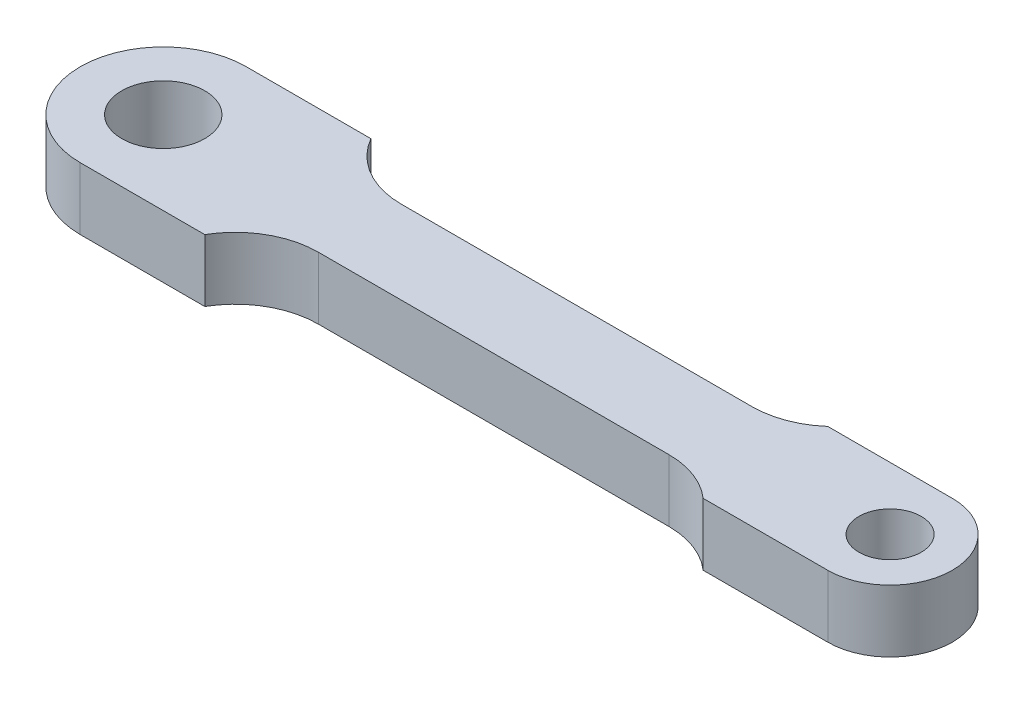
ISO-10303-21;
HEADER;
FILE_DESCRIPTION(('STEP AP214'),'2;1');
FILE_NAME('part.step','',(''),(''),'','','');
FILE_SCHEMA(('AUTOMOTIVE_DESIGN { 1 0 10303 214 1 1 1 1 }'));
ENDSEC;
DATA;
#1=APPLICATION_CONTEXT('core data for automotive mechanical design processes');
#2=APPLICATION_PROTOCOL_DEFINITION('international standard','automotive_design',2000,#1);
#3=PRODUCT_CONTEXT('',#1,'mechanical');
#4=PRODUCT('Part','Part','',(#3));
#5=PRODUCT_RELATED_PRODUCT_CATEGORY('part','',(#4));
#6=PRODUCT_DEFINITION_FORMATION('','',#4);
#7=PRODUCT_DEFINITION_CONTEXT('part definition',#1,'design');
#8=PRODUCT_DEFINITION('design','',#6,#7);
#9=PRODUCT_DEFINITION_SHAPE('','',#8);
#10=(LENGTH_UNIT() NAMED_UNIT(*) SI_UNIT(.MILLI.,.METRE.));
#11=(NAMED_UNIT(*) PLANE_ANGLE_UNIT() SI_UNIT($,.RADIAN.));
#12=(NAMED_UNIT(*) SI_UNIT($,.STERADIAN.) SOLID_ANGLE_UNIT());
#13=UNCERTAINTY_MEASURE_WITH_UNIT(LENGTH_MEASURE(1.E-05),#10,'distance_accuracy_value','');
#14=(GEOMETRIC_REPRESENTATION_CONTEXT(3) GLOBAL_UNCERTAINTY_ASSIGNED_CONTEXT((#13)) GLOBAL_UNIT_ASSIGNED_CONTEXT((#10,
#11,#12)) REPRESENTATION_CONTEXT('',''));
#15=CARTESIAN_POINT('',(0.,0.,0.));
#16=DIRECTION('',(0.,0.,1.));
#17=DIRECTION('',(1.,0.,0.));
#18=AXIS2_PLACEMENT_3D('',#15,#16,#17);
#19=CARTESIAN_POINT('',(-10.519623346751,1.5,0.));
#20=DIRECTION('',(0.,1.,0.));
#21=DIRECTION('',(0.,0.,1.));
#22=AXIS2_PLACEMENT_3D('',#19,#20,#21);
#23=PLANE('',#22);
#24=CARTESIAN_POINT('',(-10.519623346751,1.5,0.));
#25=DIRECTION('',(0.,1.,0.));
#26=DIRECTION('',(0.,0.,1.));
#27=AXIS2_PLACEMENT_3D('',#24,#25,#26);
#28=CIRCLE('',#27,2.);
#29=CARTESIAN_POINT('',(-10.519623346751,1.5,2.));
#30=VERTEX_POINT('',#29);
#31=EDGE_CURVE('E158',#30,#30,#28,.T.);
#32=ORIENTED_EDGE('',*,*,#31,.F.);
#33=EDGE_LOOP('',(#32));
#34=FACE_BOUND('',#33,.T.);
#35=CARTESIAN_POINT('',(-10.519623346751,1.5,0.));
#36=DIRECTION('',(0.,1.,0.));
#37=DIRECTION('',(0.,0.,1.));
#38=AXIS2_PLACEMENT_3D('',#35,#36,#37);
#39=CIRCLE('',#38,4.);
#40=CARTESIAN_POINT('',(-10.519623346751,1.5,-4.));
#41=VERTEX_POINT('',#40);
#42=CARTESIAN_POINT('',(-10.519623346751,1.5,4.));
#43=VERTEX_POINT('',#42);
#44=EDGE_CURVE('E177',#41,#43,#39,.T.);
#45=ORIENTED_EDGE('',*,*,#44,.T.);
#46=DIRECTION('',(1.,0.,0.));
#47=VECTOR('',#46,1.);
#48=CARTESIAN_POINT('',(-10.519623346751,1.5,4.));
#49=LINE('',#48,#47);
#50=CARTESIAN_POINT('',(-4.51962334675103,1.5,4.));
#51=VERTEX_POINT('',#50);
#52=EDGE_CURVE('E105',#43,#51,#49,.T.);
#53=ORIENTED_EDGE('',*,*,#52,.T.);
#54=CARTESIAN_POINT('',(-1.05552173161327,1.5,6.));
#55=DIRECTION('',(0.,-1.,0.));
#56=DIRECTION('',(0.,0.,-1.));
#57=AXIS2_PLACEMENT_3D('',#54,#55,#56);
#58=CIRCLE('',#57,4.);
#59=CARTESIAN_POINT('',(-1.05552173161327,1.5,2.));
#60=VERTEX_POINT('',#59);
#61=EDGE_CURVE('E204',#51,#60,#58,.T.);
#62=ORIENTED_EDGE('',*,*,#61,.T.);
#63=DIRECTION('',(1.,0.,0.));
#64=VECTOR('',#63,1.);
#65=CARTESIAN_POINT('',(-1.05552173161327,1.5,2.));
#66=LINE('',#65,#64);
#67=CARTESIAN_POINT('',(15.8346253421844,1.5,2.));
#68=VERTEX_POINT('',#67);
#69=EDGE_CURVE('E223',#60,#68,#66,.T.);
#70=ORIENTED_EDGE('',*,*,#69,.T.);
#71=CARTESIAN_POINT('',(15.8346253421844,1.5,6.));
#72=DIRECTION('',(0.,-1.,0.));
#73=DIRECTION('',(0.,0.,-1.));
#74=AXIS2_PLACEMENT_3D('',#71,#72,#73);
#75=CIRCLE('',#74,4.);
#76=CARTESIAN_POINT('',(18.480376653249,1.5,3.));
#77=VERTEX_POINT('',#76);
#78=EDGE_CURVE('E220',#68,#77,#75,.T.);
#79=ORIENTED_EDGE('',*,*,#78,.T.);
#80=DIRECTION('',(1.,0.,0.));
#81=VECTOR('',#80,1.);
#82=CARTESIAN_POINT('',(24.480376653249,1.5,3.));
#83=LINE('',#82,#81);
#84=CARTESIAN_POINT('',(24.480376653249,1.5,3.));
#85=VERTEX_POINT('',#84);
#86=EDGE_CURVE('E222',#77,#85,#83,.T.);
#87=ORIENTED_EDGE('',*,*,#86,.T.);
#88=CARTESIAN_POINT('',(24.480376653249,1.5,0.));
#89=DIRECTION('',(0.,1.,0.));
#90=DIRECTION('',(0.,0.,1.));
#91=AXIS2_PLACEMENT_3D('',#88,#89,#90);
#92=CIRCLE('',#91,3.);
#93=CARTESIAN_POINT('',(24.480376653249,1.5,-3.));
#94=VERTEX_POINT('',#93);
#95=EDGE_CURVE('E225',#85,#94,#92,.T.);
#96=ORIENTED_EDGE('',*,*,#95,.T.);
#97=DIRECTION('',(-1.,0.,0.));
#98=VECTOR('',#97,1.);
#99=CARTESIAN_POINT('',(24.480376653249,1.5,-3.));
#100=LINE('',#99,#98);
#101=CARTESIAN_POINT('',(18.480376653249,1.5,-3.));
#102=VERTEX_POINT('',#101);
#103=EDGE_CURVE('E231',#94,#102,#100,.T.);
#104=ORIENTED_EDGE('',*,*,#103,.T.);
#105=CARTESIAN_POINT('',(15.8346253421844,1.5,-6.));
#106=DIRECTION('',(0.,-1.,0.));
#107=DIRECTION('',(0.,0.,1.));
#108=AXIS2_PLACEMENT_3D('',#105,#106,#107);
#109=CIRCLE('',#108,4.);
#110=CARTESIAN_POINT('',(15.8346253421844,1.5,-2.));
#111=VERTEX_POINT('',#110);
#112=EDGE_CURVE('E136',#102,#111,#109,.T.);
#113=ORIENTED_EDGE('',*,*,#112,.T.);
#114=DIRECTION('',(-1.,0.,0.));
#115=VECTOR('',#114,1.);
#116=CARTESIAN_POINT('',(-1.05552173161327,1.5,-2.));
#117=LINE('',#116,#115);
#118=CARTESIAN_POINT('',(-1.05552173161327,1.5,-2.));
#119=VERTEX_POINT('',#118);
#120=EDGE_CURVE('E130',#111,#119,#117,.T.);
#121=ORIENTED_EDGE('',*,*,#120,.T.);
#122=CARTESIAN_POINT('',(-1.05552173161327,1.5,-6.));
#123=DIRECTION('',(0.,-1.,0.));
#124=DIRECTION('',(0.,0.,1.));
#125=AXIS2_PLACEMENT_3D('',#122,#123,#124);
#126=CIRCLE('',#125,4.);
#127=CARTESIAN_POINT('',(-4.51962334675103,1.5,-4.));
#128=VERTEX_POINT('',#127);
#129=EDGE_CURVE('E134',#119,#128,#126,.T.);
#130=ORIENTED_EDGE('',*,*,#129,.T.);
#131=DIRECTION('',(-1.,0.,0.));
#132=VECTOR('',#131,1.);
#133=CARTESIAN_POINT('',(-10.519623346751,1.5,-4.));
#134=LINE('',#133,#132);
#135=EDGE_CURVE('E50',#128,#41,#134,.T.);
#136=ORIENTED_EDGE('',*,*,#135,.T.);
#137=EDGE_LOOP('',(#45,#53,#62,#70,#79,#87,#96,#104,#113,#121,#130,#136));
#138=FACE_BOUND('',#137,.T.);
#139=CARTESIAN_POINT('',(24.480376653249,1.5,0.));
#140=DIRECTION('',(0.,1.,0.));
#141=DIRECTION('',(0.,0.,1.));
#142=AXIS2_PLACEMENT_3D('',#139,#140,#141);
#143=CIRCLE('',#142,1.5);
#144=CARTESIAN_POINT('',(24.480376653249,1.5,1.5));
#145=VERTEX_POINT('',#144);
#146=EDGE_CURVE('E273',#145,#145,#143,.T.);
#147=ORIENTED_EDGE('',*,*,#146,.F.);
#148=EDGE_LOOP('',(#147));
#149=FACE_BOUND('',#148,.T.);
#150=ADVANCED_FACE('F33',(#34,#138,#149),#23,.T.);
#151=CARTESIAN_POINT('',(-10.519623346751,-1.5,0.));
#152=DIRECTION('',(0.,1.,0.));
#153=DIRECTION('',(0.,0.,1.));
#154=AXIS2_PLACEMENT_3D('',#151,#152,#153);
#155=PLANE('',#154);
#156=CARTESIAN_POINT('',(-10.519623346751,-1.5,0.));
#157=DIRECTION('',(0.,1.,0.));
#158=DIRECTION('',(0.,0.,1.));
#159=AXIS2_PLACEMENT_3D('',#156,#157,#158);
#160=CIRCLE('',#159,4.);
#161=CARTESIAN_POINT('',(-10.519623346751,-1.5,-4.));
#162=VERTEX_POINT('',#161);
#163=CARTESIAN_POINT('',(-10.519623346751,-1.5,4.));
#164=VERTEX_POINT('',#163);
#165=EDGE_CURVE('E154',#162,#164,#160,.T.);
#166=ORIENTED_EDGE('',*,*,#165,.F.);
#167=DIRECTION('',(-1.,0.,0.));
#168=VECTOR('',#167,1.);
#169=CARTESIAN_POINT('',(-10.519623346751,-1.5,-4.));
#170=LINE('',#169,#168);
#171=CARTESIAN_POINT('',(-4.51962334675103,-1.5,-4.));
#172=VERTEX_POINT('',#171);
#173=EDGE_CURVE('E97',#172,#162,#170,.T.);
#174=ORIENTED_EDGE('',*,*,#173,.F.);
#175=CARTESIAN_POINT('',(-1.05552173161327,-1.5,-6.));
#176=DIRECTION('',(0.,-1.,0.));
#177=DIRECTION('',(0.,0.,1.));
#178=AXIS2_PLACEMENT_3D('',#175,#176,#177);
#179=CIRCLE('',#178,4.);
#180=CARTESIAN_POINT('',(-1.05552173161327,-1.5,-2.));
#181=VERTEX_POINT('',#180);
#182=EDGE_CURVE('E91',#181,#172,#179,.T.);
#183=ORIENTED_EDGE('',*,*,#182,.F.);
#184=DIRECTION('',(-1.,0.,0.));
#185=VECTOR('',#184,1.);
#186=CARTESIAN_POINT('',(-1.05552173161327,-1.5,-2.));
#187=LINE('',#186,#185);
#188=CARTESIAN_POINT('',(15.8346253421844,-1.5,-2.));
#189=VERTEX_POINT('',#188);
#190=EDGE_CURVE('E144',#189,#181,#187,.T.);
#191=ORIENTED_EDGE('',*,*,#190,.F.);
#192=CARTESIAN_POINT('',(15.8346253421844,-1.5,-6.));
#193=DIRECTION('',(0.,-1.,0.));
#194=DIRECTION('',(0.,0.,1.));
#195=AXIS2_PLACEMENT_3D('',#192,#193,#194);
#196=CIRCLE('',#195,4.);
#197=CARTESIAN_POINT('',(18.480376653249,-1.5,-3.));
#198=VERTEX_POINT('',#197);
#199=EDGE_CURVE('E172',#198,#189,#196,.T.);
#200=ORIENTED_EDGE('',*,*,#199,.F.);
#201=DIRECTION('',(-1.,0.,0.));
#202=VECTOR('',#201,1.);
#203=CARTESIAN_POINT('',(24.480376653249,-1.5,-3.));
#204=LINE('',#203,#202);
#205=CARTESIAN_POINT('',(24.480376653249,-1.5,-3.));
#206=VERTEX_POINT('',#205);
#207=EDGE_CURVE('E170',#206,#198,#204,.T.);
#208=ORIENTED_EDGE('',*,*,#207,.F.);
#209=CARTESIAN_POINT('',(24.480376653249,-1.5,0.));
#210=DIRECTION('',(0.,1.,0.));
#211=DIRECTION('',(0.,0.,1.));
#212=AXIS2_PLACEMENT_3D('',#209,#210,#211);
#213=CIRCLE('',#212,3.);
#214=CARTESIAN_POINT('',(24.480376653249,-1.5,3.));
#215=VERTEX_POINT('',#214);
#216=EDGE_CURVE('E168',#215,#206,#213,.T.);
#217=ORIENTED_EDGE('',*,*,#216,.F.);
#218=DIRECTION('',(1.,0.,0.));
#219=VECTOR('',#218,1.);
#220=CARTESIAN_POINT('',(24.480376653249,-1.5,3.));
#221=LINE('',#220,#219);
#222=CARTESIAN_POINT('',(18.480376653249,-1.5,3.));
#223=VERTEX_POINT('',#222);
#224=EDGE_CURVE('E166',#223,#215,#221,.T.);
#225=ORIENTED_EDGE('',*,*,#224,.F.);
#226=CARTESIAN_POINT('',(15.8346253421844,-1.5,6.));
#227=DIRECTION('',(0.,-1.,0.));
#228=DIRECTION('',(0.,0.,-1.));
#229=AXIS2_PLACEMENT_3D('',#226,#227,#228);
#230=CIRCLE('',#229,4.);
#231=CARTESIAN_POINT('',(15.8346253421844,-1.5,2.));
#232=VERTEX_POINT('',#231);
#233=EDGE_CURVE('E164',#232,#223,#230,.T.);
#234=ORIENTED_EDGE('',*,*,#233,.F.);
#235=DIRECTION('',(1.,0.,0.));
#236=VECTOR('',#235,1.);
#237=CARTESIAN_POINT('',(-1.05552173161327,-1.5,2.));
#238=LINE('',#237,#236);
#239=CARTESIAN_POINT('',(-1.05552173161327,-1.5,2.));
#240=VERTEX_POINT('',#239);
#241=EDGE_CURVE('E162',#240,#232,#238,.T.);
#242=ORIENTED_EDGE('',*,*,#241,.F.);
#243=CARTESIAN_POINT('',(-1.05552173161327,-1.5,6.));
#244=DIRECTION('',(0.,-1.,0.));
#245=DIRECTION('',(0.,0.,-1.));
#246=AXIS2_PLACEMENT_3D('',#243,#244,#245);
#247=CIRCLE('',#246,4.);
#248=CARTESIAN_POINT('',(-4.51962334675103,-1.5,4.));
#249=VERTEX_POINT('',#248);
#250=EDGE_CURVE('E160',#249,#240,#247,.T.);
#251=ORIENTED_EDGE('',*,*,#250,.F.);
#252=DIRECTION('',(1.,0.,0.));
#253=VECTOR('',#252,1.);
#254=CARTESIAN_POINT('',(-10.519623346751,-1.5,4.));
#255=LINE('',#254,#253);
#256=EDGE_CURVE('E157',#164,#249,#255,.T.);
#257=ORIENTED_EDGE('',*,*,#256,.F.);
#258=EDGE_LOOP('',(#166,#174,#183,#191,#200,#208,#217,#225,#234,#242,#251,#257));
#259=FACE_BOUND('',#258,.T.);
#260=CARTESIAN_POINT('',(-10.519623346751,-1.5,0.));
#261=DIRECTION('',(0.,1.,0.));
#262=DIRECTION('',(0.,0.,1.));
#263=AXIS2_PLACEMENT_3D('',#260,#261,#262);
#264=CIRCLE('',#263,2.);
#265=CARTESIAN_POINT('',(-10.519623346751,-1.5,2.));
#266=VERTEX_POINT('',#265);
#267=EDGE_CURVE('E279',#266,#266,#264,.T.);
#268=ORIENTED_EDGE('',*,*,#267,.T.);
#269=EDGE_LOOP('',(#268));
#270=FACE_BOUND('',#269,.T.);
#271=CARTESIAN_POINT('',(24.480376653249,-1.5,0.));
#272=DIRECTION('',(0.,1.,0.));
#273=DIRECTION('',(0.,0.,1.));
#274=AXIS2_PLACEMENT_3D('',#271,#272,#273);
#275=CIRCLE('',#274,1.5);
#276=CARTESIAN_POINT('',(24.480376653249,-1.5,1.5));
#277=VERTEX_POINT('',#276);
#278=EDGE_CURVE('E276',#277,#277,#275,.T.);
#279=ORIENTED_EDGE('',*,*,#278,.T.);
#280=EDGE_LOOP('',(#279));
#281=FACE_BOUND('',#280,.T.);
#282=ADVANCED_FACE('F208',(#259,#270,#281),#155,.F.);
#283=CARTESIAN_POINT('',(-10.519623346751,1.5,0.));
#284=DIRECTION('',(0.,-1.,0.));
#285=DIRECTION('',(0.,0.,-1.));
#286=AXIS2_PLACEMENT_3D('',#283,#284,#285);
#287=CYLINDRICAL_SURFACE('',#286,4.);
#288=ORIENTED_EDGE('',*,*,#165,.T.);
#289=DIRECTION('',(0.,-1.,0.));
#290=VECTOR('',#289,1.);
#291=CARTESIAN_POINT('',(-10.519623346751,1.5,4.));
#292=LINE('',#291,#290);
#293=EDGE_CURVE('E11',#43,#164,#292,.T.);
#294=ORIENTED_EDGE('',*,*,#293,.F.);
#295=ORIENTED_EDGE('',*,*,#44,.F.);
#296=DIRECTION('',(0.,-1.,0.));
#297=VECTOR('',#296,1.);
#298=CARTESIAN_POINT('',(-10.519623346751,1.5,-4.));
#299=LINE('',#298,#297);
#300=EDGE_CURVE('E150',#41,#162,#299,.T.);
#301=ORIENTED_EDGE('',*,*,#300,.T.);
#302=EDGE_LOOP('',(#288,#294,#295,#301));
#303=FACE_BOUND('',#302,.T.);
#304=ADVANCED_FACE('F35',(#303),#287,.T.);
#305=CARTESIAN_POINT('',(-10.519623346751,1.5,4.));
#306=DIRECTION('',(0.,0.,-1.));
#307=DIRECTION('',(-1.,0.,0.));
#308=AXIS2_PLACEMENT_3D('',#305,#306,#307);
#309=PLANE('',#308);
#310=ORIENTED_EDGE('',*,*,#256,.T.);
#311=DIRECTION('',(0.,-1.,0.));
#312=VECTOR('',#311,1.);
#313=CARTESIAN_POINT('',(-4.51962334675103,1.5,4.));
#314=LINE('',#313,#312);
#315=EDGE_CURVE('E42',#51,#249,#314,.T.);
#316=ORIENTED_EDGE('',*,*,#315,.F.);
#317=ORIENTED_EDGE('',*,*,#52,.F.);
#318=ORIENTED_EDGE('',*,*,#293,.T.);
#319=EDGE_LOOP('',(#310,#316,#317,#318));
#320=FACE_BOUND('',#319,.T.);
#321=ADVANCED_FACE('F372',(#320),#309,.F.);
#322=CARTESIAN_POINT('',(-1.05552173161327,1.5,6.));
#323=DIRECTION('',(0.,-1.,0.));
#324=DIRECTION('',(0.,0.,-1.));
#325=AXIS2_PLACEMENT_3D('',#322,#323,#324);
#326=CYLINDRICAL_SURFACE('',#325,4.);
#327=ORIENTED_EDGE('',*,*,#250,.T.);
#328=DIRECTION('',(0.,-1.,0.));
#329=VECTOR('',#328,1.);
#330=CARTESIAN_POINT('',(-1.05552173161327,1.5,2.));
#331=LINE('',#330,#329);
#332=EDGE_CURVE('E196',#60,#240,#331,.T.);
#333=ORIENTED_EDGE('',*,*,#332,.F.);
#334=ORIENTED_EDGE('',*,*,#61,.F.);
#335=ORIENTED_EDGE('',*,*,#315,.T.);
#336=EDGE_LOOP('',(#327,#333,#334,#335));
#337=FACE_BOUND('',#336,.T.);
#338=ADVANCED_FACE('F202',(#337),#326,.F.);
#339=CARTESIAN_POINT('',(-1.05552173161327,1.5,2.));
#340=DIRECTION('',(0.,0.,-1.));
#341=DIRECTION('',(-1.,0.,0.));
#342=AXIS2_PLACEMENT_3D('',#339,#340,#341);
#343=PLANE('',#342);
#344=ORIENTED_EDGE('',*,*,#241,.T.);
#345=DIRECTION('',(0.,-1.,0.));
#346=VECTOR('',#345,1.);
#347=CARTESIAN_POINT('',(15.8346253421844,1.5,2.));
#348=LINE('',#347,#346);
#349=EDGE_CURVE('E193',#68,#232,#348,.T.);
#350=ORIENTED_EDGE('',*,*,#349,.F.);
#351=ORIENTED_EDGE('',*,*,#69,.F.);
#352=ORIENTED_EDGE('',*,*,#332,.T.);
#353=EDGE_LOOP('',(#344,#350,#351,#352));
#354=FACE_BOUND('',#353,.T.);
#355=ADVANCED_FACE('F214',(#354),#343,.F.);
#356=CARTESIAN_POINT('',(15.8346253421844,1.5,6.));
#357=DIRECTION('',(0.,-1.,0.));
#358=DIRECTION('',(0.,0.,-1.));
#359=AXIS2_PLACEMENT_3D('',#356,#357,#358);
#360=CYLINDRICAL_SURFACE('',#359,4.);
#361=ORIENTED_EDGE('',*,*,#233,.T.);
#362=DIRECTION('',(0.,-1.,0.));
#363=VECTOR('',#362,1.);
#364=CARTESIAN_POINT('',(18.480376653249,1.5,3.));
#365=LINE('',#364,#363);
#366=EDGE_CURVE('E190',#77,#223,#365,.T.);
#367=ORIENTED_EDGE('',*,*,#366,.F.);
#368=ORIENTED_EDGE('',*,*,#78,.F.);
#369=ORIENTED_EDGE('',*,*,#349,.T.);
#370=EDGE_LOOP('',(#361,#367,#368,#369));
#371=FACE_BOUND('',#370,.T.);
#372=ADVANCED_FACE('F218',(#371),#360,.F.);
#373=CARTESIAN_POINT('',(24.480376653249,1.5,3.));
#374=DIRECTION('',(0.,0.,-1.));
#375=DIRECTION('',(-1.,0.,0.));
#376=AXIS2_PLACEMENT_3D('',#373,#374,#375);
#377=PLANE('',#376);
#378=ORIENTED_EDGE('',*,*,#224,.T.);
#379=DIRECTION('',(0.,-1.,0.));
#380=VECTOR('',#379,1.);
#381=CARTESIAN_POINT('',(24.480376653249,1.5,3.));
#382=LINE('',#381,#380);
#383=EDGE_CURVE('E187',#85,#215,#382,.T.);
#384=ORIENTED_EDGE('',*,*,#383,.F.);
#385=ORIENTED_EDGE('',*,*,#86,.F.);
#386=ORIENTED_EDGE('',*,*,#366,.T.);
#387=EDGE_LOOP('',(#378,#384,#385,#386));
#388=FACE_BOUND('',#387,.T.);
#389=ADVANCED_FACE('F337',(#388),#377,.F.);
#390=CARTESIAN_POINT('',(24.480376653249,1.5,0.));
#391=DIRECTION('',(0.,-1.,0.));
#392=DIRECTION('',(0.,0.,-1.));
#393=AXIS2_PLACEMENT_3D('',#390,#391,#392);
#394=CYLINDRICAL_SURFACE('',#393,3.);
#395=ORIENTED_EDGE('',*,*,#216,.T.);
#396=DIRECTION('',(0.,-1.,0.));
#397=VECTOR('',#396,1.);
#398=CARTESIAN_POINT('',(24.480376653249,1.5,-3.));
#399=LINE('',#398,#397);
#400=EDGE_CURVE('E184',#94,#206,#399,.T.);
#401=ORIENTED_EDGE('',*,*,#400,.F.);
#402=ORIENTED_EDGE('',*,*,#95,.F.);
#403=ORIENTED_EDGE('',*,*,#383,.T.);
#404=EDGE_LOOP('',(#395,#401,#402,#403));
#405=FACE_BOUND('',#404,.T.);
#406=ADVANCED_FACE('F328',(#405),#394,.T.);
#407=CARTESIAN_POINT('',(24.480376653249,1.5,-3.));
#408=DIRECTION('',(0.,0.,1.));
#409=DIRECTION('',(1.,0.,0.));
#410=AXIS2_PLACEMENT_3D('',#407,#408,#409);
#411=PLANE('',#410);
#412=ORIENTED_EDGE('',*,*,#207,.T.);
#413=DIRECTION('',(0.,-1.,0.));
#414=VECTOR('',#413,1.);
#415=CARTESIAN_POINT('',(18.480376653249,1.5,-3.));
#416=LINE('',#415,#414);
#417=EDGE_CURVE('E181',#102,#198,#416,.T.);
#418=ORIENTED_EDGE('',*,*,#417,.F.);
#419=ORIENTED_EDGE('',*,*,#103,.F.);
#420=ORIENTED_EDGE('',*,*,#400,.T.);
#421=EDGE_LOOP('',(#412,#418,#419,#420));
#422=FACE_BOUND('',#421,.T.);
#423=ADVANCED_FACE('F237',(#422),#411,.F.);
#424=CARTESIAN_POINT('',(15.8346253421844,1.5,-6.));
#425=DIRECTION('',(0.,-1.,0.));
#426=DIRECTION('',(0.,0.,-1.));
#427=AXIS2_PLACEMENT_3D('',#424,#425,#426);
#428=CYLINDRICAL_SURFACE('',#427,4.);
#429=ORIENTED_EDGE('',*,*,#199,.T.);
#430=DIRECTION('',(0.,-1.,0.));
#431=VECTOR('',#430,1.);
#432=CARTESIAN_POINT('',(15.8346253421844,1.5,-2.));
#433=LINE('',#432,#431);
#434=EDGE_CURVE('E145',#111,#189,#433,.T.);
#435=ORIENTED_EDGE('',*,*,#434,.F.);
#436=ORIENTED_EDGE('',*,*,#112,.F.);
#437=ORIENTED_EDGE('',*,*,#417,.T.);
#438=EDGE_LOOP('',(#429,#435,#436,#437));
#439=FACE_BOUND('',#438,.T.);
#440=ADVANCED_FACE('F241',(#439),#428,.F.);
#441=CARTESIAN_POINT('',(-1.05552173161327,1.5,-2.));
#442=DIRECTION('',(0.,0.,1.));
#443=DIRECTION('',(1.,0.,0.));
#444=AXIS2_PLACEMENT_3D('',#441,#442,#443);
#445=PLANE('',#444);
#446=ORIENTED_EDGE('',*,*,#190,.T.);
#447=DIRECTION('',(0.,-1.,0.));
#448=VECTOR('',#447,1.);
#449=CARTESIAN_POINT('',(-1.05552173161327,1.5,-2.));
#450=LINE('',#449,#448);
#451=EDGE_CURVE('E141',#119,#181,#450,.T.);
#452=ORIENTED_EDGE('',*,*,#451,.F.);
#453=ORIENTED_EDGE('',*,*,#120,.F.);
#454=ORIENTED_EDGE('',*,*,#434,.T.);
#455=EDGE_LOOP('',(#446,#452,#453,#454));
#456=FACE_BOUND('',#455,.T.);
#457=ADVANCED_FACE('F142',(#456),#445,.F.);
#458=CARTESIAN_POINT('',(-1.05552173161327,1.5,-6.));
#459=DIRECTION('',(0.,-1.,0.));
#460=DIRECTION('',(0.,0.,-1.));
#461=AXIS2_PLACEMENT_3D('',#458,#459,#460);
#462=CYLINDRICAL_SURFACE('',#461,4.);
#463=ORIENTED_EDGE('',*,*,#182,.T.);
#464=DIRECTION('',(0.,-1.,0.));
#465=VECTOR('',#464,1.);
#466=CARTESIAN_POINT('',(-4.51962334675103,1.5,-4.));
#467=LINE('',#466,#465);
#468=EDGE_CURVE('E146',#128,#172,#467,.T.);
#469=ORIENTED_EDGE('',*,*,#468,.F.);
#470=ORIENTED_EDGE('',*,*,#129,.F.);
#471=ORIENTED_EDGE('',*,*,#451,.T.);
#472=EDGE_LOOP('',(#463,#469,#470,#471));
#473=FACE_BOUND('',#472,.T.);
#474=ADVANCED_FACE('F148',(#473),#462,.F.);
#475=CARTESIAN_POINT('',(-10.519623346751,1.5,-4.));
#476=DIRECTION('',(0.,0.,1.));
#477=DIRECTION('',(1.,0.,0.));
#478=AXIS2_PLACEMENT_3D('',#475,#476,#477);
#479=PLANE('',#478);
#480=ORIENTED_EDGE('',*,*,#173,.T.);
#481=ORIENTED_EDGE('',*,*,#300,.F.);
#482=ORIENTED_EDGE('',*,*,#135,.F.);
#483=ORIENTED_EDGE('',*,*,#468,.T.);
#484=EDGE_LOOP('',(#480,#481,#482,#483));
#485=FACE_BOUND('',#484,.T.);
#486=ADVANCED_FACE('F245',(#485),#479,.F.);
#487=CARTESIAN_POINT('',(-10.519623346751,1.5,0.));
#488=DIRECTION('',(0.,-1.,0.));
#489=DIRECTION('',(0.,0.,-1.));
#490=AXIS2_PLACEMENT_3D('',#487,#488,#489);
#491=CYLINDRICAL_SURFACE('',#490,2.);
#492=ORIENTED_EDGE('',*,*,#31,.T.);
#493=EDGE_LOOP('',(#492));
#494=FACE_BOUND('',#493,.T.);
#495=ORIENTED_EDGE('',*,*,#267,.F.);
#496=EDGE_LOOP('',(#495));
#497=FACE_BOUND('',#496,.T.);
#498=ADVANCED_FACE('F247',(#494,#497),#491,.F.);
#499=CARTESIAN_POINT('',(24.480376653249,1.5,0.));
#500=DIRECTION('',(0.,-1.,0.));
#501=DIRECTION('',(0.,0.,-1.));
#502=AXIS2_PLACEMENT_3D('',#499,#500,#501);
#503=CYLINDRICAL_SURFACE('',#502,1.5);
#504=ORIENTED_EDGE('',*,*,#146,.T.);
#505=EDGE_LOOP('',(#504));
#506=FACE_BOUND('',#505,.T.);
#507=ORIENTED_EDGE('',*,*,#278,.F.);
#508=EDGE_LOOP('',(#507));
#509=FACE_BOUND('',#508,.T.);
#510=ADVANCED_FACE('F253',(#506,#509),#503,.F.);
#511=CLOSED_SHELL('',(#150,#282,#304,#321,#338,#355,#372,#389,#406,#423,#440,#457,#474,#486,
#498,#510));
#512=MANIFOLD_SOLID_BREP('B2',#511);
#513=ADVANCED_BREP_SHAPE_REPRESENTATION('',(#18,#512),#14);
#514=SHAPE_DEFINITION_REPRESENTATION(#9,#513);
ENDSEC;
END-ISO-10303-21;
